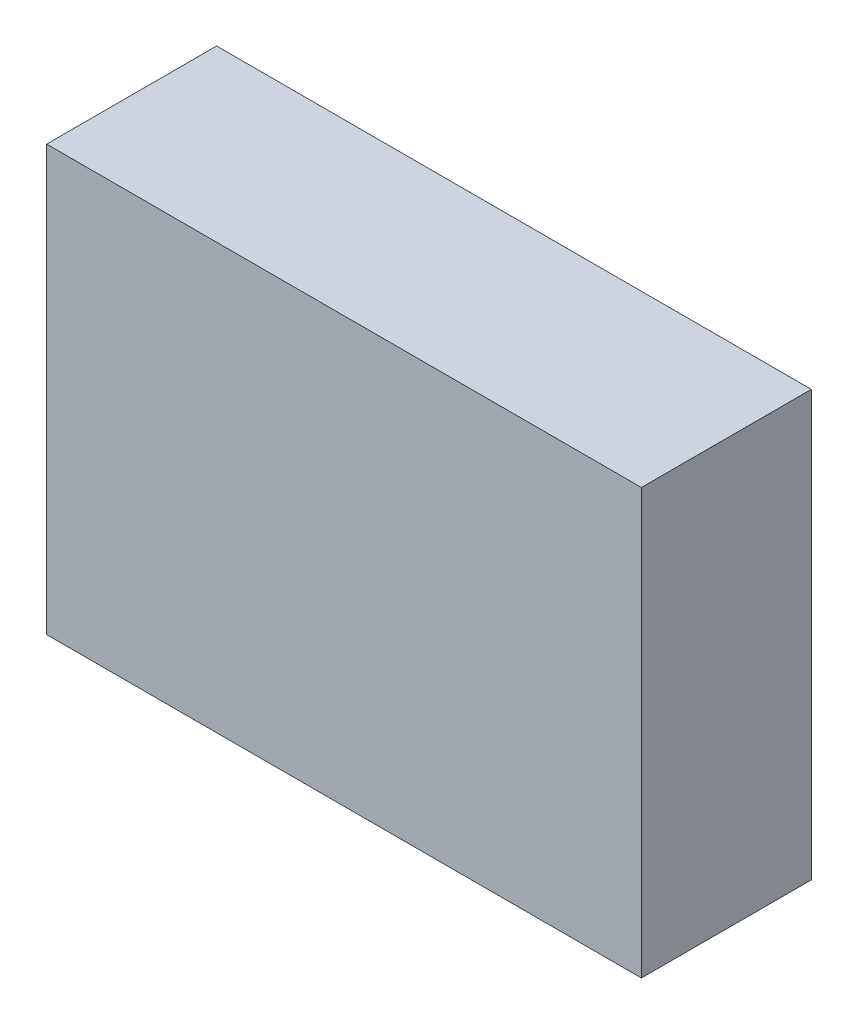
ISO-10303-21;
HEADER;
FILE_DESCRIPTION(('STEP AP214'),'2;1');
FILE_NAME('part.step','',(''),(''),'','','');
FILE_SCHEMA(('AUTOMOTIVE_DESIGN { 1 0 10303 214 1 1 1 1 }'));
ENDSEC;
DATA;
#1=APPLICATION_CONTEXT('core data for automotive mechanical design processes');
#2=APPLICATION_PROTOCOL_DEFINITION('international standard','automotive_design',2000,#1);
#3=PRODUCT_CONTEXT('',#1,'mechanical');
#4=PRODUCT('Part','Part','',(#3));
#5=PRODUCT_RELATED_PRODUCT_CATEGORY('part','',(#4));
#6=PRODUCT_DEFINITION_FORMATION('','',#4);
#7=PRODUCT_DEFINITION_CONTEXT('part definition',#1,'design');
#8=PRODUCT_DEFINITION('design','',#6,#7);
#9=PRODUCT_DEFINITION_SHAPE('','',#8);
#10=(LENGTH_UNIT() NAMED_UNIT(*) SI_UNIT(.MILLI.,.METRE.));
#11=(NAMED_UNIT(*) PLANE_ANGLE_UNIT() SI_UNIT($,.RADIAN.));
#12=(NAMED_UNIT(*) SI_UNIT($,.STERADIAN.) SOLID_ANGLE_UNIT());
#13=UNCERTAINTY_MEASURE_WITH_UNIT(LENGTH_MEASURE(1.E-05),#10,'distance_accuracy_value','');
#14=(GEOMETRIC_REPRESENTATION_CONTEXT(3) GLOBAL_UNCERTAINTY_ASSIGNED_CONTEXT((#13)) GLOBAL_UNIT_ASSIGNED_CONTEXT((#10,
#11,#12)) REPRESENTATION_CONTEXT('',''));
#15=CARTESIAN_POINT('',(0.,0.,0.));
#16=DIRECTION('',(0.,0.,1.));
#17=DIRECTION('',(1.,0.,0.));
#18=AXIS2_PLACEMENT_3D('',#15,#16,#17);
#19=CARTESIAN_POINT('',(88.9,63.5,50.8));
#20=DIRECTION('',(-1.,0.,0.));
#21=DIRECTION('',(0.,-1.,0.));
#22=AXIS2_PLACEMENT_3D('',#19,#20,#21);
#23=PLANE('',#22);
#24=DIRECTION('',(0.,1.,0.));
#25=VECTOR('',#24,1.);
#26=CARTESIAN_POINT('',(88.9,63.5,0.));
#27=LINE('',#26,#25);
#28=CARTESIAN_POINT('',(88.9,-63.5,0.));
#29=VERTEX_POINT('',#28);
#30=CARTESIAN_POINT('',(88.9,63.5,0.));
#31=VERTEX_POINT('',#30);
#32=EDGE_CURVE('E106',#29,#31,#27,.T.);
#33=ORIENTED_EDGE('',*,*,#32,.T.);
#34=DIRECTION('',(0.,0.,-1.));
#35=VECTOR('',#34,1.);
#36=CARTESIAN_POINT('',(88.9,63.5,50.8));
#37=LINE('',#36,#35);
#38=CARTESIAN_POINT('',(88.9,63.5,50.8));
#39=VERTEX_POINT('',#38);
#40=EDGE_CURVE('E11',#39,#31,#37,.T.);
#41=ORIENTED_EDGE('',*,*,#40,.F.);
#42=DIRECTION('',(0.,1.,0.));
#43=VECTOR('',#42,1.);
#44=CARTESIAN_POINT('',(88.9,63.5,50.8));
#45=LINE('',#44,#43);
#46=CARTESIAN_POINT('',(88.9,-63.5,50.8));
#47=VERTEX_POINT('',#46);
#48=EDGE_CURVE('E94',#47,#39,#45,.T.);
#49=ORIENTED_EDGE('',*,*,#48,.F.);
#50=DIRECTION('',(0.,0.,-1.));
#51=VECTOR('',#50,1.);
#52=CARTESIAN_POINT('',(88.9,-63.5,50.8));
#53=LINE('',#52,#51);
#54=EDGE_CURVE('E102',#47,#29,#53,.T.);
#55=ORIENTED_EDGE('',*,*,#54,.T.);
#56=EDGE_LOOP('',(#33,#41,#49,#55));
#57=FACE_BOUND('',#56,.T.);
#58=ADVANCED_FACE('F43',(#57),#23,.F.);
#59=CARTESIAN_POINT('',(-88.9,63.5,50.8));
#60=DIRECTION('',(0.,-1.,0.));
#61=DIRECTION('',(0.,0.,-1.));
#62=AXIS2_PLACEMENT_3D('',#59,#60,#61);
#63=PLANE('',#62);
#64=DIRECTION('',(-1.,0.,0.));
#65=VECTOR('',#64,1.);
#66=CARTESIAN_POINT('',(-88.9,63.5,0.));
#67=LINE('',#66,#65);
#68=CARTESIAN_POINT('',(-88.9,63.5,0.));
#69=VERTEX_POINT('',#68);
#70=EDGE_CURVE('E98',#31,#69,#67,.T.);
#71=ORIENTED_EDGE('',*,*,#70,.T.);
#72=DIRECTION('',(0.,0.,-1.));
#73=VECTOR('',#72,1.);
#74=CARTESIAN_POINT('',(-88.9,63.5,50.8));
#75=LINE('',#74,#73);
#76=CARTESIAN_POINT('',(-88.9,63.5,50.8));
#77=VERTEX_POINT('',#76);
#78=EDGE_CURVE('E51',#77,#69,#75,.T.);
#79=ORIENTED_EDGE('',*,*,#78,.F.);
#80=DIRECTION('',(-1.,0.,0.));
#81=VECTOR('',#80,1.);
#82=CARTESIAN_POINT('',(-88.9,63.5,50.8));
#83=LINE('',#82,#81);
#84=EDGE_CURVE('E89',#39,#77,#83,.T.);
#85=ORIENTED_EDGE('',*,*,#84,.F.);
#86=ORIENTED_EDGE('',*,*,#40,.T.);
#87=EDGE_LOOP('',(#71,#79,#85,#86));
#88=FACE_BOUND('',#87,.T.);
#89=ADVANCED_FACE('F97',(#88),#63,.F.);
#90=CARTESIAN_POINT('',(-88.9,63.5,50.8));
#91=DIRECTION('',(1.,0.,0.));
#92=DIRECTION('',(0.,0.,-1.));
#93=AXIS2_PLACEMENT_3D('',#90,#91,#92);
#94=PLANE('',#93);
#95=DIRECTION('',(0.,-1.,0.));
#96=VECTOR('',#95,1.);
#97=CARTESIAN_POINT('',(-88.9,63.5,0.));
#98=LINE('',#97,#96);
#99=CARTESIAN_POINT('',(-88.9,-63.5,0.));
#100=VERTEX_POINT('',#99);
#101=EDGE_CURVE('E76',#69,#100,#98,.T.);
#102=ORIENTED_EDGE('',*,*,#101,.T.);
#103=DIRECTION('',(0.,0.,-1.));
#104=VECTOR('',#103,1.);
#105=CARTESIAN_POINT('',(-88.9,-63.5,50.8));
#106=LINE('',#105,#104);
#107=CARTESIAN_POINT('',(-88.9,-63.5,50.8));
#108=VERTEX_POINT('',#107);
#109=EDGE_CURVE('E99',#108,#100,#106,.T.);
#110=ORIENTED_EDGE('',*,*,#109,.F.);
#111=DIRECTION('',(0.,-1.,0.));
#112=VECTOR('',#111,1.);
#113=CARTESIAN_POINT('',(-88.9,63.5,50.8));
#114=LINE('',#113,#112);
#115=EDGE_CURVE('E92',#77,#108,#114,.T.);
#116=ORIENTED_EDGE('',*,*,#115,.F.);
#117=ORIENTED_EDGE('',*,*,#78,.T.);
#118=EDGE_LOOP('',(#102,#110,#116,#117));
#119=FACE_BOUND('',#118,.T.);
#120=ADVANCED_FACE('F100',(#119),#94,.F.);
#121=CARTESIAN_POINT('',(-88.9,-63.5,50.8));
#122=DIRECTION('',(0.,1.,0.));
#123=DIRECTION('',(0.,0.,1.));
#124=AXIS2_PLACEMENT_3D('',#121,#122,#123);
#125=PLANE('',#124);
#126=DIRECTION('',(1.,0.,0.));
#127=VECTOR('',#126,1.);
#128=CARTESIAN_POINT('',(-88.9,-63.5,0.));
#129=LINE('',#128,#127);
#130=EDGE_CURVE('E82',#100,#29,#129,.T.);
#131=ORIENTED_EDGE('',*,*,#130,.T.);
#132=ORIENTED_EDGE('',*,*,#54,.F.);
#133=DIRECTION('',(1.,0.,0.));
#134=VECTOR('',#133,1.);
#135=CARTESIAN_POINT('',(-88.9,-63.5,50.8));
#136=LINE('',#135,#134);
#137=EDGE_CURVE('E59',#108,#47,#136,.T.);
#138=ORIENTED_EDGE('',*,*,#137,.F.);
#139=ORIENTED_EDGE('',*,*,#109,.T.);
#140=EDGE_LOOP('',(#131,#132,#138,#139));
#141=FACE_BOUND('',#140,.T.);
#142=ADVANCED_FACE('F113',(#141),#125,.F.);
#143=CARTESIAN_POINT('',(0.,0.,50.8));
#144=DIRECTION('',(0.,0.,1.));
#145=DIRECTION('',(1.,0.,0.));
#146=AXIS2_PLACEMENT_3D('',#143,#144,#145);
#147=PLANE('',#146);
#148=ORIENTED_EDGE('',*,*,#48,.T.);
#149=ORIENTED_EDGE('',*,*,#84,.T.);
#150=ORIENTED_EDGE('',*,*,#115,.T.);
#151=ORIENTED_EDGE('',*,*,#137,.T.);
#152=EDGE_LOOP('',(#148,#149,#150,#151));
#153=FACE_BOUND('',#152,.T.);
#154=ADVANCED_FACE('F90',(#153),#147,.T.);
#155=CARTESIAN_POINT('',(0.,0.,0.));
#156=DIRECTION('',(0.,0.,1.));
#157=DIRECTION('',(1.,0.,0.));
#158=AXIS2_PLACEMENT_3D('',#155,#156,#157);
#159=PLANE('',#158);
#160=ORIENTED_EDGE('',*,*,#32,.F.);
#161=ORIENTED_EDGE('',*,*,#130,.F.);
#162=ORIENTED_EDGE('',*,*,#101,.F.);
#163=ORIENTED_EDGE('',*,*,#70,.F.);
#164=EDGE_LOOP('',(#160,#161,#162,#163));
#165=FACE_BOUND('',#164,.T.);
#166=ADVANCED_FACE('F116',(#165),#159,.F.);
#167=CLOSED_SHELL('',(#58,#89,#120,#142,#154,#166));
#168=MANIFOLD_SOLID_BREP('B2',#167);
#169=ADVANCED_BREP_SHAPE_REPRESENTATION('',(#18,#168),#14);
#170=SHAPE_DEFINITION_REPRESENTATION(#9,#169);
ENDSEC;
END-ISO-10303-21;
